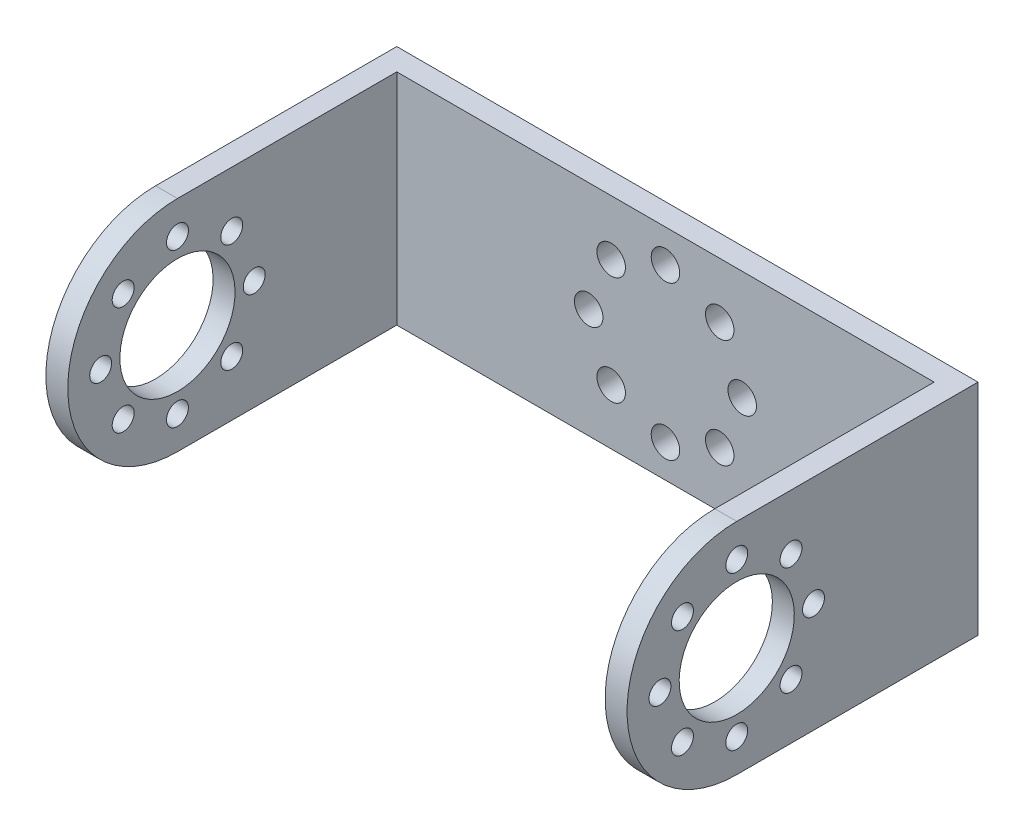
ISO-10303-21;
HEADER;
FILE_DESCRIPTION(('STEP AP214'),'2;1');
FILE_NAME('part.step','',(''),(''),'','','');
FILE_SCHEMA(('AUTOMOTIVE_DESIGN { 1 0 10303 214 1 1 1 1 }'));
ENDSEC;
DATA;
#1=APPLICATION_CONTEXT('core data for automotive mechanical design processes');
#2=APPLICATION_PROTOCOL_DEFINITION('international standard','automotive_design',2000,#1);
#3=PRODUCT_CONTEXT('',#1,'mechanical');
#4=PRODUCT('Part','Part','',(#3));
#5=PRODUCT_RELATED_PRODUCT_CATEGORY('part','',(#4));
#6=PRODUCT_DEFINITION_FORMATION('','',#4);
#7=PRODUCT_DEFINITION_CONTEXT('part definition',#1,'design');
#8=PRODUCT_DEFINITION('design','',#6,#7);
#9=PRODUCT_DEFINITION_SHAPE('','',#8);
#10=(LENGTH_UNIT() NAMED_UNIT(*) SI_UNIT(.MILLI.,.METRE.));
#11=(NAMED_UNIT(*) PLANE_ANGLE_UNIT() SI_UNIT($,.RADIAN.));
#12=(NAMED_UNIT(*) SI_UNIT($,.STERADIAN.) SOLID_ANGLE_UNIT());
#13=UNCERTAINTY_MEASURE_WITH_UNIT(LENGTH_MEASURE(1.E-05),#10,'distance_accuracy_value','');
#14=(GEOMETRIC_REPRESENTATION_CONTEXT(3) GLOBAL_UNCERTAINTY_ASSIGNED_CONTEXT((#13)) GLOBAL_UNIT_ASSIGNED_CONTEXT((#10,
#11,#12)) REPRESENTATION_CONTEXT('',''));
#15=CARTESIAN_POINT('',(0.,0.,0.));
#16=DIRECTION('',(0.,0.,1.));
#17=DIRECTION('',(1.,0.,0.));
#18=AXIS2_PLACEMENT_3D('',#15,#16,#17);
#19=CARTESIAN_POINT('',(26.5,10.,2.));
#20=DIRECTION('',(-1.,0.,0.));
#21=DIRECTION('',(0.,0.,1.));
#22=AXIS2_PLACEMENT_3D('',#19,#20,#21);
#23=PLANE('',#22);
#24=CARTESIAN_POINT('',(26.5,0.,29.));
#25=DIRECTION('',(-1.,0.,0.));
#26=DIRECTION('',(0.,-1.,0.));
#27=AXIS2_PLACEMENT_3D('',#24,#25,#26);
#28=CIRCLE('',#27,0.999999999999998);
#29=CARTESIAN_POINT('',(26.5,-1.,29.));
#30=VERTEX_POINT('',#29);
#31=EDGE_CURVE('E253',#30,#30,#28,.T.);
#32=ORIENTED_EDGE('',*,*,#31,.T.);
#33=EDGE_LOOP('',(#32));
#34=FACE_BOUND('',#33,.T.);
#35=CARTESIAN_POINT('',(26.5,4.94974746830582,17.0502525316942));
#36=DIRECTION('',(-1.,0.,0.));
#37=DIRECTION('',(0.,-1.,0.));
#38=AXIS2_PLACEMENT_3D('',#35,#36,#37);
#39=CIRCLE('',#38,0.999999999999998);
#40=CARTESIAN_POINT('',(26.5,3.94974746830583,17.0502525316942));
#41=VERTEX_POINT('',#40);
#42=EDGE_CURVE('E259',#41,#41,#39,.T.);
#43=ORIENTED_EDGE('',*,*,#42,.T.);
#44=EDGE_LOOP('',(#43));
#45=FACE_BOUND('',#44,.T.);
#46=CARTESIAN_POINT('',(26.5,6.99999999999999,22.));
#47=DIRECTION('',(-1.,0.,0.));
#48=DIRECTION('',(0.,-1.,0.));
#49=AXIS2_PLACEMENT_3D('',#46,#47,#48);
#50=CIRCLE('',#49,0.999999999999998);
#51=CARTESIAN_POINT('',(26.5,6.,22.));
#52=VERTEX_POINT('',#51);
#53=EDGE_CURVE('E260',#52,#52,#50,.T.);
#54=ORIENTED_EDGE('',*,*,#53,.T.);
#55=EDGE_LOOP('',(#54));
#56=FACE_BOUND('',#55,.T.);
#57=CARTESIAN_POINT('',(26.5,0.,22.));
#58=DIRECTION('',(-1.,0.,0.));
#59=DIRECTION('',(0.,-1.,0.));
#60=AXIS2_PLACEMENT_3D('',#57,#58,#59);
#61=CIRCLE('',#60,5.25);
#62=CARTESIAN_POINT('',(26.5,-5.25,22.));
#63=VERTEX_POINT('',#62);
#64=EDGE_CURVE('E276',#63,#63,#61,.T.);
#65=ORIENTED_EDGE('',*,*,#64,.T.);
#66=EDGE_LOOP('',(#65));
#67=FACE_BOUND('',#66,.T.);
#68=CARTESIAN_POINT('',(26.5,4.94974746830583,26.9497474683058));
#69=DIRECTION('',(-1.,0.,0.));
#70=DIRECTION('',(0.,-1.,0.));
#71=AXIS2_PLACEMENT_3D('',#68,#69,#70);
#72=CIRCLE('',#71,0.999999999999998);
#73=CARTESIAN_POINT('',(26.5,3.94974746830583,26.9497474683058));
#74=VERTEX_POINT('',#73);
#75=EDGE_CURVE('E270',#74,#74,#72,.T.);
#76=ORIENTED_EDGE('',*,*,#75,.T.);
#77=EDGE_LOOP('',(#76));
#78=FACE_BOUND('',#77,.T.);
#79=CARTESIAN_POINT('',(26.5,0.,15.));
#80=DIRECTION('',(-1.,0.,0.));
#81=DIRECTION('',(0.,-1.,0.));
#82=AXIS2_PLACEMENT_3D('',#79,#80,#81);
#83=CIRCLE('',#82,1.);
#84=CARTESIAN_POINT('',(26.5,-1.,15.));
#85=VERTEX_POINT('',#84);
#86=EDGE_CURVE('E234',#85,#85,#83,.T.);
#87=ORIENTED_EDGE('',*,*,#86,.T.);
#88=EDGE_LOOP('',(#87));
#89=FACE_BOUND('',#88,.T.);
#90=CARTESIAN_POINT('',(26.5,-4.94974746830584,17.0502525316942));
#91=DIRECTION('',(-1.,0.,0.));
#92=DIRECTION('',(0.,-1.,0.));
#93=AXIS2_PLACEMENT_3D('',#90,#91,#92);
#94=CIRCLE('',#93,0.999999999999998);
#95=CARTESIAN_POINT('',(26.5,-5.94974746830583,17.0502525316942));
#96=VERTEX_POINT('',#95);
#97=EDGE_CURVE('E233',#96,#96,#94,.T.);
#98=ORIENTED_EDGE('',*,*,#97,.T.);
#99=EDGE_LOOP('',(#98));
#100=FACE_BOUND('',#99,.T.);
#101=CARTESIAN_POINT('',(26.5,-7.,22.));
#102=DIRECTION('',(-1.,0.,0.));
#103=DIRECTION('',(0.,-1.,0.));
#104=AXIS2_PLACEMENT_3D('',#101,#102,#103);
#105=CIRCLE('',#104,0.999999999999998);
#106=CARTESIAN_POINT('',(26.5,-8.,22.));
#107=VERTEX_POINT('',#106);
#108=EDGE_CURVE('E241',#107,#107,#105,.T.);
#109=ORIENTED_EDGE('',*,*,#108,.T.);
#110=EDGE_LOOP('',(#109));
#111=FACE_BOUND('',#110,.T.);
#112=CARTESIAN_POINT('',(26.5,-4.94974746830583,26.9497474683058));
#113=DIRECTION('',(-1.,0.,0.));
#114=DIRECTION('',(0.,-1.,0.));
#115=AXIS2_PLACEMENT_3D('',#112,#113,#114);
#116=CIRCLE('',#115,0.999999999999998);
#117=CARTESIAN_POINT('',(26.5,-5.94974746830583,26.9497474683058));
#118=VERTEX_POINT('',#117);
#119=EDGE_CURVE('E247',#118,#118,#116,.T.);
#120=ORIENTED_EDGE('',*,*,#119,.T.);
#121=EDGE_LOOP('',(#120));
#122=FACE_BOUND('',#121,.T.);
#123=CARTESIAN_POINT('',(26.5,0.,22.));
#124=DIRECTION('',(-1.,0.,0.));
#125=DIRECTION('',(0.,0.,1.));
#126=AXIS2_PLACEMENT_3D('',#123,#124,#125);
#127=CIRCLE('',#126,10.);
#128=CARTESIAN_POINT('',(26.5,10.,22.));
#129=VERTEX_POINT('',#128);
#130=CARTESIAN_POINT('',(26.5,-10.,22.));
#131=VERTEX_POINT('',#130);
#132=EDGE_CURVE('E109',#129,#131,#127,.F.);
#133=ORIENTED_EDGE('',*,*,#132,.T.);
#134=DIRECTION('',(0.,0.,-1.));
#135=VECTOR('',#134,1.);
#136=CARTESIAN_POINT('',(26.5,-10.,2.));
#137=LINE('',#136,#135);
#138=CARTESIAN_POINT('',(26.5,-10.,0.));
#139=VERTEX_POINT('',#138);
#140=EDGE_CURVE('E113',#131,#139,#137,.T.);
#141=ORIENTED_EDGE('',*,*,#140,.T.);
#142=DIRECTION('',(0.,1.,0.));
#143=VECTOR('',#142,1.);
#144=CARTESIAN_POINT('',(26.5,10.,0.));
#145=LINE('',#144,#143);
#146=CARTESIAN_POINT('',(26.5,10.,0.));
#147=VERTEX_POINT('',#146);
#148=EDGE_CURVE('E189',#139,#147,#145,.T.);
#149=ORIENTED_EDGE('',*,*,#148,.T.);
#150=DIRECTION('',(0.,0.,-1.));
#151=VECTOR('',#150,1.);
#152=CARTESIAN_POINT('',(26.5,10.,2.));
#153=LINE('',#152,#151);
#154=EDGE_CURVE('E209',#129,#147,#153,.T.);
#155=ORIENTED_EDGE('',*,*,#154,.F.);
#156=EDGE_LOOP('',(#133,#141,#149,#155));
#157=FACE_BOUND('',#156,.T.);
#158=ADVANCED_FACE('F38',(#34,#45,#56,#67,#78,#89,#100,#111,#122,#157),#23,.F.);
#159=CARTESIAN_POINT('',(24.5,10.,32.));
#160=DIRECTION('',(-1.,0.,0.));
#161=DIRECTION('',(0.,-1.,0.));
#162=AXIS2_PLACEMENT_3D('',#159,#160,#161);
#163=PLANE('',#162);
#164=CARTESIAN_POINT('',(24.5,0.,29.));
#165=DIRECTION('',(-1.,0.,0.));
#166=DIRECTION('',(0.,-1.,0.));
#167=AXIS2_PLACEMENT_3D('',#164,#165,#166);
#168=CIRCLE('',#167,0.999999999999998);
#169=CARTESIAN_POINT('',(24.5,-1.,29.));
#170=VERTEX_POINT('',#169);
#171=EDGE_CURVE('E229',#170,#170,#168,.T.);
#172=ORIENTED_EDGE('',*,*,#171,.F.);
#173=EDGE_LOOP('',(#172));
#174=FACE_BOUND('',#173,.T.);
#175=CARTESIAN_POINT('',(24.5,4.94974746830583,17.0502525316942));
#176=DIRECTION('',(-1.,0.,0.));
#177=DIRECTION('',(0.,-1.,0.));
#178=AXIS2_PLACEMENT_3D('',#175,#176,#177);
#179=CIRCLE('',#178,0.999999999999998);
#180=CARTESIAN_POINT('',(24.5,3.94974746830583,17.0502525316942));
#181=VERTEX_POINT('',#180);
#182=EDGE_CURVE('E237',#181,#181,#179,.T.);
#183=ORIENTED_EDGE('',*,*,#182,.F.);
#184=EDGE_LOOP('',(#183));
#185=FACE_BOUND('',#184,.T.);
#186=CARTESIAN_POINT('',(24.5,7.,22.));
#187=DIRECTION('',(-1.,0.,0.));
#188=DIRECTION('',(0.,-1.,0.));
#189=AXIS2_PLACEMENT_3D('',#186,#187,#188);
#190=CIRCLE('',#189,0.999999999999998);
#191=CARTESIAN_POINT('',(24.5,6.,22.));
#192=VERTEX_POINT('',#191);
#193=EDGE_CURVE('E256',#192,#192,#190,.T.);
#194=ORIENTED_EDGE('',*,*,#193,.F.);
#195=EDGE_LOOP('',(#194));
#196=FACE_BOUND('',#195,.T.);
#197=CARTESIAN_POINT('',(24.5,0.,22.));
#198=DIRECTION('',(-1.,0.,0.));
#199=DIRECTION('',(0.,-1.,0.));
#200=AXIS2_PLACEMENT_3D('',#197,#198,#199);
#201=CIRCLE('',#200,5.25);
#202=CARTESIAN_POINT('',(24.5,-5.25,22.));
#203=VERTEX_POINT('',#202);
#204=EDGE_CURVE('E273',#203,#203,#201,.T.);
#205=ORIENTED_EDGE('',*,*,#204,.F.);
#206=EDGE_LOOP('',(#205));
#207=FACE_BOUND('',#206,.T.);
#208=CARTESIAN_POINT('',(24.5,4.94974746830583,26.9497474683058));
#209=DIRECTION('',(-1.,0.,0.));
#210=DIRECTION('',(0.,-1.,0.));
#211=AXIS2_PLACEMENT_3D('',#208,#209,#210);
#212=CIRCLE('',#211,0.999999999999998);
#213=CARTESIAN_POINT('',(24.5,3.94974746830583,26.9497474683058));
#214=VERTEX_POINT('',#213);
#215=EDGE_CURVE('E263',#214,#214,#212,.T.);
#216=ORIENTED_EDGE('',*,*,#215,.F.);
#217=EDGE_LOOP('',(#216));
#218=FACE_BOUND('',#217,.T.);
#219=CARTESIAN_POINT('',(24.5,0.,15.));
#220=DIRECTION('',(-1.,0.,0.));
#221=DIRECTION('',(0.,-1.,0.));
#222=AXIS2_PLACEMENT_3D('',#219,#220,#221);
#223=CIRCLE('',#222,1.);
#224=CARTESIAN_POINT('',(24.5,-1.,15.));
#225=VERTEX_POINT('',#224);
#226=EDGE_CURVE('E230',#225,#225,#223,.T.);
#227=ORIENTED_EDGE('',*,*,#226,.F.);
#228=EDGE_LOOP('',(#227));
#229=FACE_BOUND('',#228,.T.);
#230=CARTESIAN_POINT('',(24.5,-4.94974746830583,17.0502525316942));
#231=DIRECTION('',(-1.,0.,0.));
#232=DIRECTION('',(0.,-1.,0.));
#233=AXIS2_PLACEMENT_3D('',#230,#231,#232);
#234=CIRCLE('',#233,0.999999999999998);
#235=CARTESIAN_POINT('',(24.5,-5.94974746830583,17.0502525316942));
#236=VERTEX_POINT('',#235);
#237=EDGE_CURVE('E238',#236,#236,#234,.T.);
#238=ORIENTED_EDGE('',*,*,#237,.F.);
#239=EDGE_LOOP('',(#238));
#240=FACE_BOUND('',#239,.T.);
#241=CARTESIAN_POINT('',(24.5,-7.,22.));
#242=DIRECTION('',(-1.,0.,0.));
#243=DIRECTION('',(0.,-1.,0.));
#244=AXIS2_PLACEMENT_3D('',#241,#242,#243);
#245=CIRCLE('',#244,0.999999999999998);
#246=CARTESIAN_POINT('',(24.5,-8.,22.));
#247=VERTEX_POINT('',#246);
#248=EDGE_CURVE('E244',#247,#247,#245,.T.);
#249=ORIENTED_EDGE('',*,*,#248,.F.);
#250=EDGE_LOOP('',(#249));
#251=FACE_BOUND('',#250,.T.);
#252=CARTESIAN_POINT('',(24.5,-4.94974746830583,26.9497474683058));
#253=DIRECTION('',(-1.,0.,0.));
#254=DIRECTION('',(0.,-1.,0.));
#255=AXIS2_PLACEMENT_3D('',#252,#253,#254);
#256=CIRCLE('',#255,0.999999999999998);
#257=CARTESIAN_POINT('',(24.5,-5.94974746830583,26.9497474683058));
#258=VERTEX_POINT('',#257);
#259=EDGE_CURVE('E250',#258,#258,#256,.T.);
#260=ORIENTED_EDGE('',*,*,#259,.F.);
#261=EDGE_LOOP('',(#260));
#262=FACE_BOUND('',#261,.T.);
#263=DIRECTION('',(0.,0.,-1.));
#264=VECTOR('',#263,1.);
#265=CARTESIAN_POINT('',(24.5,-10.,32.));
#266=LINE('',#265,#264);
#267=CARTESIAN_POINT('',(24.5,-10.,22.));
#268=VERTEX_POINT('',#267);
#269=CARTESIAN_POINT('',(24.5,-10.,2.));
#270=VERTEX_POINT('',#269);
#271=EDGE_CURVE('E59',#268,#270,#266,.T.);
#272=ORIENTED_EDGE('',*,*,#271,.F.);
#273=CARTESIAN_POINT('',(24.5,0.,22.));
#274=DIRECTION('',(-1.,0.,0.));
#275=DIRECTION('',(0.,-1.,0.));
#276=AXIS2_PLACEMENT_3D('',#273,#274,#275);
#277=CIRCLE('',#276,10.);
#278=CARTESIAN_POINT('',(24.5,10.,22.));
#279=VERTEX_POINT('',#278);
#280=EDGE_CURVE('E104',#279,#268,#277,.F.);
#281=ORIENTED_EDGE('',*,*,#280,.F.);
#282=DIRECTION('',(0.,0.,-1.));
#283=VECTOR('',#282,1.);
#284=CARTESIAN_POINT('',(24.5,10.,32.));
#285=LINE('',#284,#283);
#286=CARTESIAN_POINT('',(24.5,10.,2.));
#287=VERTEX_POINT('',#286);
#288=EDGE_CURVE('E52',#279,#287,#285,.T.);
#289=ORIENTED_EDGE('',*,*,#288,.T.);
#290=DIRECTION('',(0.,1.,0.));
#291=VECTOR('',#290,1.);
#292=CARTESIAN_POINT('',(24.5,10.,2.));
#293=LINE('',#292,#291);
#294=EDGE_CURVE('E115',#270,#287,#293,.T.);
#295=ORIENTED_EDGE('',*,*,#294,.F.);
#296=EDGE_LOOP('',(#272,#281,#289,#295));
#297=FACE_BOUND('',#296,.T.);
#298=ADVANCED_FACE('F114',(#174,#185,#196,#207,#218,#229,#240,#251,#262,#297),#163,.T.);
#299=CARTESIAN_POINT('',(-26.5,10.,2.));
#300=DIRECTION('',(0.,-1.,0.));
#301=DIRECTION('',(0.,0.,-1.));
#302=AXIS2_PLACEMENT_3D('',#299,#300,#301);
#303=PLANE('',#302);
#304=DIRECTION('',(1.,0.,0.));
#305=VECTOR('',#304,1.);
#306=CARTESIAN_POINT('',(-26.5,10.,22.));
#307=LINE('',#306,#305);
#308=EDGE_CURVE('E108',#279,#129,#307,.T.);
#309=ORIENTED_EDGE('',*,*,#308,.T.);
#310=ORIENTED_EDGE('',*,*,#154,.T.);
#311=DIRECTION('',(-1.,0.,0.));
#312=VECTOR('',#311,1.);
#313=CARTESIAN_POINT('',(-26.5,10.,0.));
#314=LINE('',#313,#312);
#315=CARTESIAN_POINT('',(-26.5,10.,0.));
#316=VERTEX_POINT('',#315);
#317=EDGE_CURVE('E197',#147,#316,#314,.T.);
#318=ORIENTED_EDGE('',*,*,#317,.T.);
#319=DIRECTION('',(0.,0.,-1.));
#320=VECTOR('',#319,1.);
#321=CARTESIAN_POINT('',(-26.5,10.,2.));
#322=LINE('',#321,#320);
#323=CARTESIAN_POINT('',(-26.5,10.,22.));
#324=VERTEX_POINT('',#323);
#325=EDGE_CURVE('E207',#324,#316,#322,.T.);
#326=ORIENTED_EDGE('',*,*,#325,.F.);
#327=DIRECTION('',(-1.,0.,0.));
#328=VECTOR('',#327,1.);
#329=CARTESIAN_POINT('',(26.5,10.,22.));
#330=LINE('',#329,#328);
#331=CARTESIAN_POINT('',(-24.5,10.,22.));
#332=VERTEX_POINT('',#331);
#333=EDGE_CURVE('E129',#332,#324,#330,.T.);
#334=ORIENTED_EDGE('',*,*,#333,.F.);
#335=DIRECTION('',(0.,0.,-1.));
#336=VECTOR('',#335,1.);
#337=CARTESIAN_POINT('',(-24.5,10.,32.));
#338=LINE('',#337,#336);
#339=CARTESIAN_POINT('',(-24.5,10.,2.));
#340=VERTEX_POINT('',#339);
#341=EDGE_CURVE('E184',#332,#340,#338,.T.);
#342=ORIENTED_EDGE('',*,*,#341,.T.);
#343=DIRECTION('',(-1.,0.,0.));
#344=VECTOR('',#343,1.);
#345=CARTESIAN_POINT('',(-26.5,10.,2.));
#346=LINE('',#345,#344);
#347=EDGE_CURVE('E190',#287,#340,#346,.T.);
#348=ORIENTED_EDGE('',*,*,#347,.F.);
#349=ORIENTED_EDGE('',*,*,#288,.F.);
#350=EDGE_LOOP('',(#309,#310,#318,#326,#334,#342,#348,#349));
#351=FACE_BOUND('',#350,.T.);
#352=ADVANCED_FACE('F363',(#351),#303,.F.);
#353=CARTESIAN_POINT('',(-26.5,10.,2.));
#354=DIRECTION('',(1.,0.,0.));
#355=DIRECTION('',(0.,1.,0.));
#356=AXIS2_PLACEMENT_3D('',#353,#354,#355);
#357=PLANE('',#356);
#358=CARTESIAN_POINT('',(-26.5,0.,29.));
#359=DIRECTION('',(-1.,0.,0.));
#360=DIRECTION('',(0.,-1.,0.));
#361=AXIS2_PLACEMENT_3D('',#358,#359,#360);
#362=CIRCLE('',#361,0.999999999999998);
#363=CARTESIAN_POINT('',(-26.5,-1.,29.));
#364=VERTEX_POINT('',#363);
#365=EDGE_CURVE('E122',#364,#364,#362,.T.);
#366=ORIENTED_EDGE('',*,*,#365,.F.);
#367=EDGE_LOOP('',(#366));
#368=FACE_BOUND('',#367,.T.);
#369=CARTESIAN_POINT('',(-26.5,4.94974746830582,17.0502525316942));
#370=DIRECTION('',(-1.,0.,0.));
#371=DIRECTION('',(0.,-1.,0.));
#372=AXIS2_PLACEMENT_3D('',#369,#370,#371);
#373=CIRCLE('',#372,0.999999999999998);
#374=CARTESIAN_POINT('',(-26.5,3.94974746830583,17.0502525316942));
#375=VERTEX_POINT('',#374);
#376=EDGE_CURVE('E142',#375,#375,#373,.T.);
#377=ORIENTED_EDGE('',*,*,#376,.F.);
#378=EDGE_LOOP('',(#377));
#379=FACE_BOUND('',#378,.T.);
#380=CARTESIAN_POINT('',(-26.5,6.99999999999999,22.));
#381=DIRECTION('',(-1.,0.,0.));
#382=DIRECTION('',(0.,-1.,0.));
#383=AXIS2_PLACEMENT_3D('',#380,#381,#382);
#384=CIRCLE('',#383,0.999999999999998);
#385=CARTESIAN_POINT('',(-26.5,6.,22.));
#386=VERTEX_POINT('',#385);
#387=EDGE_CURVE('E141',#386,#386,#384,.T.);
#388=ORIENTED_EDGE('',*,*,#387,.F.);
#389=EDGE_LOOP('',(#388));
#390=FACE_BOUND('',#389,.T.);
#391=CARTESIAN_POINT('',(-26.5,0.,22.));
#392=DIRECTION('',(-1.,0.,0.));
#393=DIRECTION('',(0.,-1.,0.));
#394=AXIS2_PLACEMENT_3D('',#391,#392,#393);
#395=CIRCLE('',#394,5.25);
#396=CARTESIAN_POINT('',(-26.5,-5.25,22.));
#397=VERTEX_POINT('',#396);
#398=EDGE_CURVE('E117',#397,#397,#395,.T.);
#399=ORIENTED_EDGE('',*,*,#398,.F.);
#400=EDGE_LOOP('',(#399));
#401=FACE_BOUND('',#400,.T.);
#402=CARTESIAN_POINT('',(-26.5,4.94974746830583,26.9497474683058));
#403=DIRECTION('',(-1.,0.,0.));
#404=DIRECTION('',(0.,-1.,0.));
#405=AXIS2_PLACEMENT_3D('',#402,#403,#404);
#406=CIRCLE('',#405,0.999999999999998);
#407=CARTESIAN_POINT('',(-26.5,3.94974746830583,26.9497474683058));
#408=VERTEX_POINT('',#407);
#409=EDGE_CURVE('E135',#408,#408,#406,.T.);
#410=ORIENTED_EDGE('',*,*,#409,.F.);
#411=EDGE_LOOP('',(#410));
#412=FACE_BOUND('',#411,.T.);
#413=CARTESIAN_POINT('',(-26.5,0.,15.));
#414=DIRECTION('',(-1.,0.,0.));
#415=DIRECTION('',(0.,-1.,0.));
#416=AXIS2_PLACEMENT_3D('',#413,#414,#415);
#417=CIRCLE('',#416,1.);
#418=CARTESIAN_POINT('',(-26.5,-1.,15.));
#419=VERTEX_POINT('',#418);
#420=EDGE_CURVE('E149',#419,#419,#417,.T.);
#421=ORIENTED_EDGE('',*,*,#420,.F.);
#422=EDGE_LOOP('',(#421));
#423=FACE_BOUND('',#422,.T.);
#424=CARTESIAN_POINT('',(-26.5,-4.94974746830584,17.0502525316942));
#425=DIRECTION('',(-1.,0.,0.));
#426=DIRECTION('',(0.,-1.,0.));
#427=AXIS2_PLACEMENT_3D('',#424,#425,#426);
#428=CIRCLE('',#427,0.999999999999998);
#429=CARTESIAN_POINT('',(-26.5,-5.94974746830583,17.0502525316942));
#430=VERTEX_POINT('',#429);
#431=EDGE_CURVE('E166',#430,#430,#428,.T.);
#432=ORIENTED_EDGE('',*,*,#431,.F.);
#433=EDGE_LOOP('',(#432));
#434=FACE_BOUND('',#433,.T.);
#435=CARTESIAN_POINT('',(-26.5,-7.,22.));
#436=DIRECTION('',(-1.,0.,0.));
#437=DIRECTION('',(0.,-1.,0.));
#438=AXIS2_PLACEMENT_3D('',#435,#436,#437);
#439=CIRCLE('',#438,0.999999999999998);
#440=CARTESIAN_POINT('',(-26.5,-8.,22.));
#441=VERTEX_POINT('',#440);
#442=EDGE_CURVE('E160',#441,#441,#439,.T.);
#443=ORIENTED_EDGE('',*,*,#442,.F.);
#444=EDGE_LOOP('',(#443));
#445=FACE_BOUND('',#444,.T.);
#446=CARTESIAN_POINT('',(-26.5,-4.94974746830583,26.9497474683058));
#447=DIRECTION('',(-1.,0.,0.));
#448=DIRECTION('',(0.,-1.,0.));
#449=AXIS2_PLACEMENT_3D('',#446,#447,#448);
#450=CIRCLE('',#449,0.999999999999998);
#451=CARTESIAN_POINT('',(-26.5,-5.94974746830583,26.9497474683058));
#452=VERTEX_POINT('',#451);
#453=EDGE_CURVE('E154',#452,#452,#450,.T.);
#454=ORIENTED_EDGE('',*,*,#453,.F.);
#455=EDGE_LOOP('',(#454));
#456=FACE_BOUND('',#455,.T.);
#457=DIRECTION('',(0.,0.,-1.));
#458=VECTOR('',#457,1.);
#459=CARTESIAN_POINT('',(-26.5,-10.,2.));
#460=LINE('',#459,#458);
#461=CARTESIAN_POINT('',(-26.5,-10.,22.));
#462=VERTEX_POINT('',#461);
#463=CARTESIAN_POINT('',(-26.5,-10.,0.));
#464=VERTEX_POINT('',#463);
#465=EDGE_CURVE('E205',#462,#464,#460,.T.);
#466=ORIENTED_EDGE('',*,*,#465,.F.);
#467=CARTESIAN_POINT('',(-26.5,0.,22.));
#468=DIRECTION('',(1.,0.,0.));
#469=DIRECTION('',(0.,1.,0.));
#470=AXIS2_PLACEMENT_3D('',#467,#468,#469);
#471=CIRCLE('',#470,10.);
#472=EDGE_CURVE('E179',#324,#462,#471,.T.);
#473=ORIENTED_EDGE('',*,*,#472,.F.);
#474=ORIENTED_EDGE('',*,*,#325,.T.);
#475=DIRECTION('',(0.,-1.,0.));
#476=VECTOR('',#475,1.);
#477=CARTESIAN_POINT('',(-26.5,10.,0.));
#478=LINE('',#477,#476);
#479=EDGE_CURVE('E200',#316,#464,#478,.T.);
#480=ORIENTED_EDGE('',*,*,#479,.T.);
#481=EDGE_LOOP('',(#466,#473,#474,#480));
#482=FACE_BOUND('',#481,.T.);
#483=ADVANCED_FACE('F217',(#368,#379,#390,#401,#412,#423,#434,#445,#456,#482),#357,.F.);
#484=CARTESIAN_POINT('',(-24.5,10.,32.));
#485=DIRECTION('',(-1.,0.,0.));
#486=DIRECTION('',(0.,-1.,0.));
#487=AXIS2_PLACEMENT_3D('',#484,#485,#486);
#488=PLANE('',#487);
#489=CARTESIAN_POINT('',(-24.5,0.,29.));
#490=DIRECTION('',(-1.,0.,0.));
#491=DIRECTION('',(0.,-1.,0.));
#492=AXIS2_PLACEMENT_3D('',#489,#490,#491);
#493=CIRCLE('',#492,0.999999999999998);
#494=CARTESIAN_POINT('',(-24.5,-1.,29.));
#495=VERTEX_POINT('',#494);
#496=EDGE_CURVE('E125',#495,#495,#493,.F.);
#497=ORIENTED_EDGE('',*,*,#496,.F.);
#498=EDGE_LOOP('',(#497));
#499=FACE_BOUND('',#498,.T.);
#500=CARTESIAN_POINT('',(-24.5,4.94974746830583,17.0502525316942));
#501=DIRECTION('',(-1.,0.,0.));
#502=DIRECTION('',(0.,-1.,0.));
#503=AXIS2_PLACEMENT_3D('',#500,#501,#502);
#504=CIRCLE('',#503,0.999999999999998);
#505=CARTESIAN_POINT('',(-24.5,3.94974746830583,17.0502525316942));
#506=VERTEX_POINT('',#505);
#507=EDGE_CURVE('E145',#506,#506,#504,.F.);
#508=ORIENTED_EDGE('',*,*,#507,.F.);
#509=EDGE_LOOP('',(#508));
#510=FACE_BOUND('',#509,.T.);
#511=CARTESIAN_POINT('',(-24.5,7.,22.));
#512=DIRECTION('',(-1.,0.,0.));
#513=DIRECTION('',(0.,-1.,0.));
#514=AXIS2_PLACEMENT_3D('',#511,#512,#513);
#515=CIRCLE('',#514,0.999999999999998);
#516=CARTESIAN_POINT('',(-24.5,6.,22.));
#517=VERTEX_POINT('',#516);
#518=EDGE_CURVE('E146',#517,#517,#515,.F.);
#519=ORIENTED_EDGE('',*,*,#518,.F.);
#520=EDGE_LOOP('',(#519));
#521=FACE_BOUND('',#520,.T.);
#522=CARTESIAN_POINT('',(-24.5,0.,22.));
#523=DIRECTION('',(-1.,0.,0.));
#524=DIRECTION('',(0.,-1.,0.));
#525=AXIS2_PLACEMENT_3D('',#522,#523,#524);
#526=CIRCLE('',#525,5.25);
#527=CARTESIAN_POINT('',(-24.5,-5.25,22.));
#528=VERTEX_POINT('',#527);
#529=EDGE_CURVE('E132',#528,#528,#526,.F.);
#530=ORIENTED_EDGE('',*,*,#529,.F.);
#531=EDGE_LOOP('',(#530));
#532=FACE_BOUND('',#531,.T.);
#533=CARTESIAN_POINT('',(-24.5,4.94974746830583,26.9497474683058));
#534=DIRECTION('',(-1.,0.,0.));
#535=DIRECTION('',(0.,-1.,0.));
#536=AXIS2_PLACEMENT_3D('',#533,#534,#535);
#537=CIRCLE('',#536,0.999999999999998);
#538=CARTESIAN_POINT('',(-24.5,3.94974746830583,26.9497474683058));
#539=VERTEX_POINT('',#538);
#540=EDGE_CURVE('E138',#539,#539,#537,.F.);
#541=ORIENTED_EDGE('',*,*,#540,.F.);
#542=EDGE_LOOP('',(#541));
#543=FACE_BOUND('',#542,.T.);
#544=CARTESIAN_POINT('',(-24.5,0.,15.));
#545=DIRECTION('',(-1.,0.,0.));
#546=DIRECTION('',(0.,-1.,0.));
#547=AXIS2_PLACEMENT_3D('',#544,#545,#546);
#548=CIRCLE('',#547,1.);
#549=CARTESIAN_POINT('',(-24.5,-1.,15.));
#550=VERTEX_POINT('',#549);
#551=EDGE_CURVE('E169',#550,#550,#548,.F.);
#552=ORIENTED_EDGE('',*,*,#551,.F.);
#553=EDGE_LOOP('',(#552));
#554=FACE_BOUND('',#553,.T.);
#555=CARTESIAN_POINT('',(-24.5,-4.94974746830583,17.0502525316942));
#556=DIRECTION('',(-1.,0.,0.));
#557=DIRECTION('',(0.,-1.,0.));
#558=AXIS2_PLACEMENT_3D('',#555,#556,#557);
#559=CIRCLE('',#558,0.999999999999998);
#560=CARTESIAN_POINT('',(-24.5,-5.94974746830583,17.0502525316942));
#561=VERTEX_POINT('',#560);
#562=EDGE_CURVE('E163',#561,#561,#559,.F.);
#563=ORIENTED_EDGE('',*,*,#562,.F.);
#564=EDGE_LOOP('',(#563));
#565=FACE_BOUND('',#564,.T.);
#566=CARTESIAN_POINT('',(-24.5,-7.,22.));
#567=DIRECTION('',(-1.,0.,0.));
#568=DIRECTION('',(0.,-1.,0.));
#569=AXIS2_PLACEMENT_3D('',#566,#567,#568);
#570=CIRCLE('',#569,0.999999999999998);
#571=CARTESIAN_POINT('',(-24.5,-8.,22.));
#572=VERTEX_POINT('',#571);
#573=EDGE_CURVE('E157',#572,#572,#570,.F.);
#574=ORIENTED_EDGE('',*,*,#573,.F.);
#575=EDGE_LOOP('',(#574));
#576=FACE_BOUND('',#575,.T.);
#577=CARTESIAN_POINT('',(-24.5,-4.94974746830583,26.9497474683058));
#578=DIRECTION('',(-1.,0.,0.));
#579=DIRECTION('',(0.,-1.,0.));
#580=AXIS2_PLACEMENT_3D('',#577,#578,#579);
#581=CIRCLE('',#580,0.999999999999998);
#582=CARTESIAN_POINT('',(-24.5,-5.94974746830583,26.9497474683058));
#583=VERTEX_POINT('',#582);
#584=EDGE_CURVE('E126',#583,#583,#581,.F.);
#585=ORIENTED_EDGE('',*,*,#584,.F.);
#586=EDGE_LOOP('',(#585));
#587=FACE_BOUND('',#586,.T.);
#588=CARTESIAN_POINT('',(-24.5,0.,22.));
#589=DIRECTION('',(-1.,0.,0.));
#590=DIRECTION('',(0.,-1.,0.));
#591=AXIS2_PLACEMENT_3D('',#588,#589,#590);
#592=CIRCLE('',#591,10.);
#593=CARTESIAN_POINT('',(-24.5,-10.,22.));
#594=VERTEX_POINT('',#593);
#595=EDGE_CURVE('E177',#594,#332,#592,.T.);
#596=ORIENTED_EDGE('',*,*,#595,.F.);
#597=DIRECTION('',(0.,0.,-1.));
#598=VECTOR('',#597,1.);
#599=CARTESIAN_POINT('',(-24.5,-10.,32.));
#600=LINE('',#599,#598);
#601=CARTESIAN_POINT('',(-24.5,-10.,2.));
#602=VERTEX_POINT('',#601);
#603=EDGE_CURVE('E187',#594,#602,#600,.T.);
#604=ORIENTED_EDGE('',*,*,#603,.T.);
#605=DIRECTION('',(0.,1.,0.));
#606=VECTOR('',#605,1.);
#607=CARTESIAN_POINT('',(-24.5,10.,2.));
#608=LINE('',#607,#606);
#609=EDGE_CURVE('E181',#602,#340,#608,.T.);
#610=ORIENTED_EDGE('',*,*,#609,.T.);
#611=ORIENTED_EDGE('',*,*,#341,.F.);
#612=EDGE_LOOP('',(#596,#604,#610,#611));
#613=FACE_BOUND('',#612,.T.);
#614=ADVANCED_FACE('F447',(#499,#510,#521,#532,#543,#554,#565,#576,#587,#613),#488,.F.);
#615=CARTESIAN_POINT('',(-26.5,-10.,2.));
#616=DIRECTION('',(0.,1.,0.));
#617=DIRECTION('',(0.,0.,1.));
#618=AXIS2_PLACEMENT_3D('',#615,#616,#617);
#619=PLANE('',#618);
#620=ORIENTED_EDGE('',*,*,#140,.F.);
#621=DIRECTION('',(-1.,0.,0.));
#622=VECTOR('',#621,1.);
#623=CARTESIAN_POINT('',(54.5,-10.,22.));
#624=LINE('',#623,#622);
#625=EDGE_CURVE('E11',#131,#268,#624,.T.);
#626=ORIENTED_EDGE('',*,*,#625,.T.);
#627=ORIENTED_EDGE('',*,*,#271,.T.);
#628=DIRECTION('',(1.,0.,0.));
#629=VECTOR('',#628,1.);
#630=CARTESIAN_POINT('',(-26.5,-10.,2.));
#631=LINE('',#630,#629);
#632=EDGE_CURVE('E192',#602,#270,#631,.T.);
#633=ORIENTED_EDGE('',*,*,#632,.F.);
#634=ORIENTED_EDGE('',*,*,#603,.F.);
#635=DIRECTION('',(1.,0.,0.));
#636=VECTOR('',#635,1.);
#637=CARTESIAN_POINT('',(-54.5,-10.,22.));
#638=LINE('',#637,#636);
#639=EDGE_CURVE('E45',#594,#462,#638,.F.);
#640=ORIENTED_EDGE('',*,*,#639,.T.);
#641=ORIENTED_EDGE('',*,*,#465,.T.);
#642=DIRECTION('',(1.,0.,0.));
#643=VECTOR('',#642,1.);
#644=CARTESIAN_POINT('',(-26.5,-10.,0.));
#645=LINE('',#644,#643);
#646=EDGE_CURVE('E193',#464,#139,#645,.T.);
#647=ORIENTED_EDGE('',*,*,#646,.T.);
#648=EDGE_LOOP('',(#620,#626,#627,#633,#634,#640,#641,#647));
#649=FACE_BOUND('',#648,.T.);
#650=ADVANCED_FACE('F111',(#649),#619,.F.);
#651=CARTESIAN_POINT('',(0.,0.,2.));
#652=DIRECTION('',(0.,0.,1.));
#653=DIRECTION('',(1.,0.,0.));
#654=AXIS2_PLACEMENT_3D('',#651,#652,#653);
#655=PLANE('',#654);
#656=CARTESIAN_POINT('',(4.94974746830589,-4.94974746830577,2.));
#657=DIRECTION('',(0.,0.,1.));
#658=DIRECTION('',(1.,0.,0.));
#659=AXIS2_PLACEMENT_3D('',#656,#657,#658);
#660=CIRCLE('',#659,1.3);
#661=CARTESIAN_POINT('',(6.24974746830589,-4.94974746830577,2.));
#662=VERTEX_POINT('',#661);
#663=EDGE_CURVE('E279',#662,#662,#660,.T.);
#664=ORIENTED_EDGE('',*,*,#663,.F.);
#665=EDGE_LOOP('',(#664));
#666=FACE_BOUND('',#665,.T.);
#667=CARTESIAN_POINT('',(0.,-7.,2.));
#668=DIRECTION('',(0.,0.,1.));
#669=DIRECTION('',(1.,0.,0.));
#670=AXIS2_PLACEMENT_3D('',#667,#668,#669);
#671=CIRCLE('',#670,1.3);
#672=CARTESIAN_POINT('',(1.30000000000007,-7.,2.));
#673=VERTEX_POINT('',#672);
#674=EDGE_CURVE('E286',#673,#673,#671,.T.);
#675=ORIENTED_EDGE('',*,*,#674,.F.);
#676=EDGE_LOOP('',(#675));
#677=FACE_BOUND('',#676,.T.);
#678=CARTESIAN_POINT('',(-4.94974746830579,-4.94974746830588,2.));
#679=DIRECTION('',(0.,0.,1.));
#680=DIRECTION('',(1.,0.,0.));
#681=AXIS2_PLACEMENT_3D('',#678,#679,#680);
#682=CIRCLE('',#681,1.3);
#683=CARTESIAN_POINT('',(-3.64974746830579,-4.94974746830588,2.));
#684=VERTEX_POINT('',#683);
#685=EDGE_CURVE('E289',#684,#684,#682,.T.);
#686=ORIENTED_EDGE('',*,*,#685,.F.);
#687=EDGE_LOOP('',(#686));
#688=FACE_BOUND('',#687,.T.);
#689=CARTESIAN_POINT('',(-7.,0.,2.));
#690=DIRECTION('',(0.,0.,1.));
#691=DIRECTION('',(1.,0.,0.));
#692=AXIS2_PLACEMENT_3D('',#689,#690,#691);
#693=CIRCLE('',#692,1.3);
#694=CARTESIAN_POINT('',(-5.7,0.,2.));
#695=VERTEX_POINT('',#694);
#696=EDGE_CURVE('E292',#695,#695,#693,.T.);
#697=ORIENTED_EDGE('',*,*,#696,.F.);
#698=EDGE_LOOP('',(#697));
#699=FACE_BOUND('',#698,.T.);
#700=CARTESIAN_POINT('',(-4.94974746830586,4.94974746830581,2.));
#701=DIRECTION('',(0.,0.,1.));
#702=DIRECTION('',(1.,0.,0.));
#703=AXIS2_PLACEMENT_3D('',#700,#701,#702);
#704=CIRCLE('',#703,1.3);
#705=CARTESIAN_POINT('',(-3.64974746830586,4.94974746830581,2.));
#706=VERTEX_POINT('',#705);
#707=EDGE_CURVE('E295',#706,#706,#704,.T.);
#708=ORIENTED_EDGE('',*,*,#707,.F.);
#709=EDGE_LOOP('',(#708));
#710=FACE_BOUND('',#709,.T.);
#711=CARTESIAN_POINT('',(0.,7.,2.));
#712=DIRECTION('',(0.,0.,1.));
#713=DIRECTION('',(1.,0.,0.));
#714=AXIS2_PLACEMENT_3D('',#711,#712,#713);
#715=CIRCLE('',#714,1.3);
#716=CARTESIAN_POINT('',(1.29999999999998,7.,2.));
#717=VERTEX_POINT('',#716);
#718=EDGE_CURVE('E298',#717,#717,#715,.T.);
#719=ORIENTED_EDGE('',*,*,#718,.F.);
#720=EDGE_LOOP('',(#719));
#721=FACE_BOUND('',#720,.T.);
#722=CARTESIAN_POINT('',(4.94974746830583,4.94974746830584,2.));
#723=DIRECTION('',(0.,0.,1.));
#724=DIRECTION('',(1.,0.,0.));
#725=AXIS2_PLACEMENT_3D('',#722,#723,#724);
#726=CIRCLE('',#725,1.3);
#727=CARTESIAN_POINT('',(6.24974746830583,4.94974746830584,2.));
#728=VERTEX_POINT('',#727);
#729=EDGE_CURVE('E301',#728,#728,#726,.T.);
#730=ORIENTED_EDGE('',*,*,#729,.F.);
#731=EDGE_LOOP('',(#730));
#732=FACE_BOUND('',#731,.T.);
#733=CARTESIAN_POINT('',(7.,0.,2.));
#734=DIRECTION('',(0.,0.,1.));
#735=DIRECTION('',(1.,0.,0.));
#736=AXIS2_PLACEMENT_3D('',#733,#734,#735);
#737=CIRCLE('',#736,1.3);
#738=CARTESIAN_POINT('',(8.3,0.,2.));
#739=VERTEX_POINT('',#738);
#740=EDGE_CURVE('E304',#739,#739,#737,.T.);
#741=ORIENTED_EDGE('',*,*,#740,.F.);
#742=EDGE_LOOP('',(#741));
#743=FACE_BOUND('',#742,.T.);
#744=ORIENTED_EDGE('',*,*,#294,.T.);
#745=ORIENTED_EDGE('',*,*,#347,.T.);
#746=ORIENTED_EDGE('',*,*,#609,.F.);
#747=ORIENTED_EDGE('',*,*,#632,.T.);
#748=EDGE_LOOP('',(#744,#745,#746,#747));
#749=FACE_BOUND('',#748,.T.);
#750=ADVANCED_FACE('F337',(#666,#677,#688,#699,#710,#721,#732,#743,#749),#655,.T.);
#751=CARTESIAN_POINT('',(0.,0.,0.));
#752=DIRECTION('',(0.,0.,1.));
#753=DIRECTION('',(1.,0.,0.));
#754=AXIS2_PLACEMENT_3D('',#751,#752,#753);
#755=PLANE('',#754);
#756=CARTESIAN_POINT('',(4.94974746830589,-4.94974746830577,0.));
#757=DIRECTION('',(0.,0.,-1.));
#758=DIRECTION('',(-1.,0.,0.));
#759=AXIS2_PLACEMENT_3D('',#756,#757,#758);
#760=CIRCLE('',#759,1.3);
#761=CARTESIAN_POINT('',(3.64974746830589,-4.94974746830577,0.));
#762=VERTEX_POINT('',#761);
#763=EDGE_CURVE('E311',#762,#762,#760,.T.);
#764=ORIENTED_EDGE('',*,*,#763,.F.);
#765=EDGE_LOOP('',(#764));
#766=FACE_BOUND('',#765,.T.);
#767=CARTESIAN_POINT('',(0.,-7.,0.));
#768=DIRECTION('',(0.,0.,-1.));
#769=DIRECTION('',(-1.,0.,0.));
#770=AXIS2_PLACEMENT_3D('',#767,#768,#769);
#771=CIRCLE('',#770,1.3);
#772=CARTESIAN_POINT('',(-1.29999999999993,-7.,0.));
#773=VERTEX_POINT('',#772);
#774=EDGE_CURVE('E314',#773,#773,#771,.T.);
#775=ORIENTED_EDGE('',*,*,#774,.F.);
#776=EDGE_LOOP('',(#775));
#777=FACE_BOUND('',#776,.T.);
#778=CARTESIAN_POINT('',(-4.94974746830579,-4.94974746830588,0.));
#779=DIRECTION('',(0.,0.,-1.));
#780=DIRECTION('',(-1.,0.,0.));
#781=AXIS2_PLACEMENT_3D('',#778,#779,#780);
#782=CIRCLE('',#781,1.3);
#783=CARTESIAN_POINT('',(-6.24974746830579,-4.94974746830588,0.));
#784=VERTEX_POINT('',#783);
#785=EDGE_CURVE('E317',#784,#784,#782,.T.);
#786=ORIENTED_EDGE('',*,*,#785,.F.);
#787=EDGE_LOOP('',(#786));
#788=FACE_BOUND('',#787,.T.);
#789=CARTESIAN_POINT('',(-7.,0.,0.));
#790=DIRECTION('',(0.,0.,-1.));
#791=DIRECTION('',(-1.,0.,0.));
#792=AXIS2_PLACEMENT_3D('',#789,#790,#791);
#793=CIRCLE('',#792,1.3);
#794=CARTESIAN_POINT('',(-8.3,0.,0.));
#795=VERTEX_POINT('',#794);
#796=EDGE_CURVE('E320',#795,#795,#793,.T.);
#797=ORIENTED_EDGE('',*,*,#796,.F.);
#798=EDGE_LOOP('',(#797));
#799=FACE_BOUND('',#798,.T.);
#800=CARTESIAN_POINT('',(-4.94974746830586,4.94974746830581,0.));
#801=DIRECTION('',(0.,0.,-1.));
#802=DIRECTION('',(-1.,0.,0.));
#803=AXIS2_PLACEMENT_3D('',#800,#801,#802);
#804=CIRCLE('',#803,1.3);
#805=CARTESIAN_POINT('',(-6.24974746830586,4.94974746830581,0.));
#806=VERTEX_POINT('',#805);
#807=EDGE_CURVE('E323',#806,#806,#804,.T.);
#808=ORIENTED_EDGE('',*,*,#807,.F.);
#809=EDGE_LOOP('',(#808));
#810=FACE_BOUND('',#809,.T.);
#811=CARTESIAN_POINT('',(0.,7.,0.));
#812=DIRECTION('',(0.,0.,-1.));
#813=DIRECTION('',(-1.,0.,0.));
#814=AXIS2_PLACEMENT_3D('',#811,#812,#813);
#815=CIRCLE('',#814,1.3);
#816=CARTESIAN_POINT('',(-1.30000000000002,7.,0.));
#817=VERTEX_POINT('',#816);
#818=EDGE_CURVE('E326',#817,#817,#815,.T.);
#819=ORIENTED_EDGE('',*,*,#818,.F.);
#820=EDGE_LOOP('',(#819));
#821=FACE_BOUND('',#820,.T.);
#822=CARTESIAN_POINT('',(4.94974746830583,4.94974746830584,0.));
#823=DIRECTION('',(0.,0.,-1.));
#824=DIRECTION('',(-1.,0.,0.));
#825=AXIS2_PLACEMENT_3D('',#822,#823,#824);
#826=CIRCLE('',#825,1.3);
#827=CARTESIAN_POINT('',(3.64974746830583,4.94974746830584,0.));
#828=VERTEX_POINT('',#827);
#829=EDGE_CURVE('E310',#828,#828,#826,.T.);
#830=ORIENTED_EDGE('',*,*,#829,.F.);
#831=EDGE_LOOP('',(#830));
#832=FACE_BOUND('',#831,.T.);
#833=CARTESIAN_POINT('',(7.,0.,0.));
#834=DIRECTION('',(0.,0.,-1.));
#835=DIRECTION('',(-1.,0.,0.));
#836=AXIS2_PLACEMENT_3D('',#833,#834,#835);
#837=CIRCLE('',#836,1.3);
#838=CARTESIAN_POINT('',(5.7,0.,0.));
#839=VERTEX_POINT('',#838);
#840=EDGE_CURVE('E307',#839,#839,#837,.T.);
#841=ORIENTED_EDGE('',*,*,#840,.F.);
#842=EDGE_LOOP('',(#841));
#843=FACE_BOUND('',#842,.T.);
#844=ORIENTED_EDGE('',*,*,#148,.F.);
#845=ORIENTED_EDGE('',*,*,#646,.F.);
#846=ORIENTED_EDGE('',*,*,#479,.F.);
#847=ORIENTED_EDGE('',*,*,#317,.F.);
#848=EDGE_LOOP('',(#844,#845,#846,#847));
#849=FACE_BOUND('',#848,.T.);
#850=ADVANCED_FACE('F224',(#766,#777,#788,#799,#810,#821,#832,#843,#849),#755,.F.);
#851=CARTESIAN_POINT('',(26.5,0.,22.));
#852=DIRECTION('',(-1.,0.,0.));
#853=DIRECTION('',(0.,-1.,0.));
#854=AXIS2_PLACEMENT_3D('',#851,#852,#853);
#855=CYLINDRICAL_SURFACE('',#854,10.);
#856=ORIENTED_EDGE('',*,*,#595,.T.);
#857=ORIENTED_EDGE('',*,*,#333,.T.);
#858=ORIENTED_EDGE('',*,*,#472,.T.);
#859=ORIENTED_EDGE('',*,*,#639,.F.);
#860=EDGE_LOOP('',(#856,#857,#858,#859));
#861=FACE_BOUND('',#860,.T.);
#862=ADVANCED_FACE('F336',(#861),#855,.T.);
#863=CARTESIAN_POINT('',(26.501,-4.94974746830582,26.9497474683058));
#864=DIRECTION('',(-1.,0.,0.));
#865=DIRECTION('',(0.,-1.,0.));
#866=AXIS2_PLACEMENT_3D('',#863,#864,#865);
#867=CYLINDRICAL_SURFACE('',#866,0.999999999999998);
#868=ORIENTED_EDGE('',*,*,#453,.T.);
#869=EDGE_LOOP('',(#868));
#870=FACE_BOUND('',#869,.T.);
#871=ORIENTED_EDGE('',*,*,#584,.T.);
#872=EDGE_LOOP('',(#871));
#873=FACE_BOUND('',#872,.T.);
#874=ADVANCED_FACE('F430',(#870,#873),#867,.F.);
#875=CARTESIAN_POINT('',(26.501,-6.99999999999999,22.));
#876=DIRECTION('',(-1.,0.,0.));
#877=DIRECTION('',(0.,-1.,0.));
#878=AXIS2_PLACEMENT_3D('',#875,#876,#877);
#879=CYLINDRICAL_SURFACE('',#878,0.999999999999998);
#880=ORIENTED_EDGE('',*,*,#442,.T.);
#881=EDGE_LOOP('',(#880));
#882=FACE_BOUND('',#881,.T.);
#883=ORIENTED_EDGE('',*,*,#573,.T.);
#884=EDGE_LOOP('',(#883));
#885=FACE_BOUND('',#884,.T.);
#886=ADVANCED_FACE('F433',(#882,#885),#879,.F.);
#887=CARTESIAN_POINT('',(26.501,-4.94974746830583,17.0502525316942));
#888=DIRECTION('',(-1.,0.,0.));
#889=DIRECTION('',(0.,-1.,0.));
#890=AXIS2_PLACEMENT_3D('',#887,#888,#889);
#891=CYLINDRICAL_SURFACE('',#890,0.999999999999998);
#892=ORIENTED_EDGE('',*,*,#431,.T.);
#893=EDGE_LOOP('',(#892));
#894=FACE_BOUND('',#893,.T.);
#895=ORIENTED_EDGE('',*,*,#562,.T.);
#896=EDGE_LOOP('',(#895));
#897=FACE_BOUND('',#896,.T.);
#898=ADVANCED_FACE('F437',(#894,#897),#891,.F.);
#899=CARTESIAN_POINT('',(26.501,0.,15.));
#900=DIRECTION('',(-1.,0.,0.));
#901=DIRECTION('',(0.,-1.,0.));
#902=AXIS2_PLACEMENT_3D('',#899,#900,#901);
#903=CYLINDRICAL_SURFACE('',#902,1.);
#904=ORIENTED_EDGE('',*,*,#420,.T.);
#905=EDGE_LOOP('',(#904));
#906=FACE_BOUND('',#905,.T.);
#907=ORIENTED_EDGE('',*,*,#551,.T.);
#908=EDGE_LOOP('',(#907));
#909=FACE_BOUND('',#908,.T.);
#910=ADVANCED_FACE('F422',(#906,#909),#903,.F.);
#911=CARTESIAN_POINT('',(26.501,4.94974746830584,26.9497474683058));
#912=DIRECTION('',(-1.,0.,0.));
#913=DIRECTION('',(0.,-1.,0.));
#914=AXIS2_PLACEMENT_3D('',#911,#912,#913);
#915=CYLINDRICAL_SURFACE('',#914,0.999999999999998);
#916=ORIENTED_EDGE('',*,*,#409,.T.);
#917=EDGE_LOOP('',(#916));
#918=FACE_BOUND('',#917,.T.);
#919=ORIENTED_EDGE('',*,*,#540,.T.);
#920=EDGE_LOOP('',(#919));
#921=FACE_BOUND('',#920,.T.);
#922=ADVANCED_FACE('F418',(#918,#921),#915,.F.);
#923=CARTESIAN_POINT('',(26.501,0.,22.));
#924=DIRECTION('',(-1.,0.,0.));
#925=DIRECTION('',(0.,-1.,0.));
#926=AXIS2_PLACEMENT_3D('',#923,#924,#925);
#927=CYLINDRICAL_SURFACE('',#926,5.25);
#928=ORIENTED_EDGE('',*,*,#398,.T.);
#929=EDGE_LOOP('',(#928));
#930=FACE_BOUND('',#929,.T.);
#931=ORIENTED_EDGE('',*,*,#529,.T.);
#932=EDGE_LOOP('',(#931));
#933=FACE_BOUND('',#932,.T.);
#934=ADVANCED_FACE('F414',(#930,#933),#927,.F.);
#935=CARTESIAN_POINT('',(26.501,7.,22.));
#936=DIRECTION('',(-1.,0.,0.));
#937=DIRECTION('',(0.,-1.,0.));
#938=AXIS2_PLACEMENT_3D('',#935,#936,#937);
#939=CYLINDRICAL_SURFACE('',#938,0.999999999999998);
#940=ORIENTED_EDGE('',*,*,#387,.T.);
#941=EDGE_LOOP('',(#940));
#942=FACE_BOUND('',#941,.T.);
#943=ORIENTED_EDGE('',*,*,#518,.T.);
#944=EDGE_LOOP('',(#943));
#945=FACE_BOUND('',#944,.T.);
#946=ADVANCED_FACE('F417',(#942,#945),#939,.F.);
#947=CARTESIAN_POINT('',(26.501,4.94974746830583,17.0502525316942));
#948=DIRECTION('',(-1.,0.,0.));
#949=DIRECTION('',(0.,-1.,0.));
#950=AXIS2_PLACEMENT_3D('',#947,#948,#949);
#951=CYLINDRICAL_SURFACE('',#950,0.999999999999998);
#952=ORIENTED_EDGE('',*,*,#376,.T.);
#953=EDGE_LOOP('',(#952));
#954=FACE_BOUND('',#953,.T.);
#955=ORIENTED_EDGE('',*,*,#507,.T.);
#956=EDGE_LOOP('',(#955));
#957=FACE_BOUND('',#956,.T.);
#958=ADVANCED_FACE('F412',(#954,#957),#951,.F.);
#959=CARTESIAN_POINT('',(26.501,0.,29.));
#960=DIRECTION('',(-1.,0.,0.));
#961=DIRECTION('',(0.,-1.,0.));
#962=AXIS2_PLACEMENT_3D('',#959,#960,#961);
#963=CYLINDRICAL_SURFACE('',#962,0.999999999999998);
#964=ORIENTED_EDGE('',*,*,#365,.T.);
#965=EDGE_LOOP('',(#964));
#966=FACE_BOUND('',#965,.T.);
#967=ORIENTED_EDGE('',*,*,#496,.T.);
#968=EDGE_LOOP('',(#967));
#969=FACE_BOUND('',#968,.T.);
#970=ADVANCED_FACE('F396',(#966,#969),#963,.F.);
#971=CARTESIAN_POINT('',(-26.5,0.,22.));
#972=DIRECTION('',(1.,0.,0.));
#973=DIRECTION('',(0.,1.,0.));
#974=AXIS2_PLACEMENT_3D('',#971,#972,#973);
#975=CYLINDRICAL_SURFACE('',#974,10.);
#976=ORIENTED_EDGE('',*,*,#308,.F.);
#977=ORIENTED_EDGE('',*,*,#280,.T.);
#978=ORIENTED_EDGE('',*,*,#625,.F.);
#979=ORIENTED_EDGE('',*,*,#132,.F.);
#980=EDGE_LOOP('',(#976,#977,#978,#979));
#981=FACE_BOUND('',#980,.T.);
#982=ADVANCED_FACE('F105',(#981),#975,.T.);
#983=CARTESIAN_POINT('',(-26.501,-4.94974746830582,26.9497474683058));
#984=DIRECTION('',(1.,0.,0.));
#985=DIRECTION('',(0.,1.,0.));
#986=AXIS2_PLACEMENT_3D('',#983,#984,#985);
#987=CYLINDRICAL_SURFACE('',#986,0.999999999999998);
#988=ORIENTED_EDGE('',*,*,#259,.T.);
#989=EDGE_LOOP('',(#988));
#990=FACE_BOUND('',#989,.T.);
#991=ORIENTED_EDGE('',*,*,#119,.F.);
#992=EDGE_LOOP('',(#991));
#993=FACE_BOUND('',#992,.T.);
#994=ADVANCED_FACE('F384',(#990,#993),#987,.F.);
#995=CARTESIAN_POINT('',(-26.501,-6.99999999999999,22.));
#996=DIRECTION('',(1.,0.,0.));
#997=DIRECTION('',(0.,1.,0.));
#998=AXIS2_PLACEMENT_3D('',#995,#996,#997);
#999=CYLINDRICAL_SURFACE('',#998,0.999999999999998);
#1000=ORIENTED_EDGE('',*,*,#248,.T.);
#1001=EDGE_LOOP('',(#1000));
#1002=FACE_BOUND('',#1001,.T.);
#1003=ORIENTED_EDGE('',*,*,#108,.F.);
#1004=EDGE_LOOP('',(#1003));
#1005=FACE_BOUND('',#1004,.T.);
#1006=ADVANCED_FACE('F386',(#1002,#1005),#999,.F.);
#1007=CARTESIAN_POINT('',(-26.501,-4.94974746830583,17.0502525316942));
#1008=DIRECTION('',(1.,0.,0.));
#1009=DIRECTION('',(0.,1.,0.));
#1010=AXIS2_PLACEMENT_3D('',#1007,#1008,#1009);
#1011=CYLINDRICAL_SURFACE('',#1010,0.999999999999998);
#1012=ORIENTED_EDGE('',*,*,#237,.T.);
#1013=EDGE_LOOP('',(#1012));
#1014=FACE_BOUND('',#1013,.T.);
#1015=ORIENTED_EDGE('',*,*,#97,.F.);
#1016=EDGE_LOOP('',(#1015));
#1017=FACE_BOUND('',#1016,.T.);
#1018=ADVANCED_FACE('F393',(#1014,#1017),#1011,.F.);
#1019=CARTESIAN_POINT('',(-26.501,0.,15.));
#1020=DIRECTION('',(1.,0.,0.));
#1021=DIRECTION('',(0.,1.,0.));
#1022=AXIS2_PLACEMENT_3D('',#1019,#1020,#1021);
#1023=CYLINDRICAL_SURFACE('',#1022,1.);
#1024=ORIENTED_EDGE('',*,*,#226,.T.);
#1025=EDGE_LOOP('',(#1024));
#1026=FACE_BOUND('',#1025,.T.);
#1027=ORIENTED_EDGE('',*,*,#86,.F.);
#1028=EDGE_LOOP('',(#1027));
#1029=FACE_BOUND('',#1028,.T.);
#1030=ADVANCED_FACE('F404',(#1026,#1029),#1023,.F.);
#1031=CARTESIAN_POINT('',(-26.501,4.94974746830584,26.9497474683058));
#1032=DIRECTION('',(1.,0.,0.));
#1033=DIRECTION('',(0.,1.,0.));
#1034=AXIS2_PLACEMENT_3D('',#1031,#1032,#1033);
#1035=CYLINDRICAL_SURFACE('',#1034,0.999999999999998);
#1036=ORIENTED_EDGE('',*,*,#215,.T.);
#1037=EDGE_LOOP('',(#1036));
#1038=FACE_BOUND('',#1037,.T.);
#1039=ORIENTED_EDGE('',*,*,#75,.F.);
#1040=EDGE_LOOP('',(#1039));
#1041=FACE_BOUND('',#1040,.T.);
#1042=ADVANCED_FACE('F407',(#1038,#1041),#1035,.F.);
#1043=CARTESIAN_POINT('',(-26.501,0.,22.));
#1044=DIRECTION('',(1.,0.,0.));
#1045=DIRECTION('',(0.,1.,0.));
#1046=AXIS2_PLACEMENT_3D('',#1043,#1044,#1045);
#1047=CYLINDRICAL_SURFACE('',#1046,5.25);
#1048=ORIENTED_EDGE('',*,*,#204,.T.);
#1049=EDGE_LOOP('',(#1048));
#1050=FACE_BOUND('',#1049,.T.);
#1051=ORIENTED_EDGE('',*,*,#64,.F.);
#1052=EDGE_LOOP('',(#1051));
#1053=FACE_BOUND('',#1052,.T.);
#1054=ADVANCED_FACE('F567',(#1050,#1053),#1047,.F.);
#1055=CARTESIAN_POINT('',(-26.501,7.,22.));
#1056=DIRECTION('',(1.,0.,0.));
#1057=DIRECTION('',(0.,1.,0.));
#1058=AXIS2_PLACEMENT_3D('',#1055,#1056,#1057);
#1059=CYLINDRICAL_SURFACE('',#1058,0.999999999999998);
#1060=ORIENTED_EDGE('',*,*,#193,.T.);
#1061=EDGE_LOOP('',(#1060));
#1062=FACE_BOUND('',#1061,.T.);
#1063=ORIENTED_EDGE('',*,*,#53,.F.);
#1064=EDGE_LOOP('',(#1063));
#1065=FACE_BOUND('',#1064,.T.);
#1066=ADVANCED_FACE('F399',(#1062,#1065),#1059,.F.);
#1067=CARTESIAN_POINT('',(-26.501,4.94974746830583,17.0502525316942));
#1068=DIRECTION('',(1.,0.,0.));
#1069=DIRECTION('',(0.,1.,0.));
#1070=AXIS2_PLACEMENT_3D('',#1067,#1068,#1069);
#1071=CYLINDRICAL_SURFACE('',#1070,0.999999999999998);
#1072=ORIENTED_EDGE('',*,*,#182,.T.);
#1073=EDGE_LOOP('',(#1072));
#1074=FACE_BOUND('',#1073,.T.);
#1075=ORIENTED_EDGE('',*,*,#42,.F.);
#1076=EDGE_LOOP('',(#1075));
#1077=FACE_BOUND('',#1076,.T.);
#1078=ADVANCED_FACE('F354',(#1074,#1077),#1071,.F.);
#1079=CARTESIAN_POINT('',(-26.501,0.,29.));
#1080=DIRECTION('',(1.,0.,0.));
#1081=DIRECTION('',(0.,1.,0.));
#1082=AXIS2_PLACEMENT_3D('',#1079,#1080,#1081);
#1083=CYLINDRICAL_SURFACE('',#1082,0.999999999999998);
#1084=ORIENTED_EDGE('',*,*,#171,.T.);
#1085=EDGE_LOOP('',(#1084));
#1086=FACE_BOUND('',#1085,.T.);
#1087=ORIENTED_EDGE('',*,*,#31,.F.);
#1088=EDGE_LOOP('',(#1087));
#1089=FACE_BOUND('',#1088,.T.);
#1090=ADVANCED_FACE('F344',(#1086,#1089),#1083,.F.);
#1091=CARTESIAN_POINT('',(7.,0.,32.));
#1092=DIRECTION('',(0.,0.,-1.));
#1093=DIRECTION('',(-1.,0.,0.));
#1094=AXIS2_PLACEMENT_3D('',#1091,#1092,#1093);
#1095=CYLINDRICAL_SURFACE('',#1094,1.3);
#1096=ORIENTED_EDGE('',*,*,#740,.T.);
#1097=EDGE_LOOP('',(#1096));
#1098=FACE_BOUND('',#1097,.T.);
#1099=ORIENTED_EDGE('',*,*,#840,.T.);
#1100=EDGE_LOOP('',(#1099));
#1101=FACE_BOUND('',#1100,.T.);
#1102=ADVANCED_FACE('F342',(#1098,#1101),#1095,.F.);
#1103=CARTESIAN_POINT('',(4.94974746830583,4.94974746830584,32.));
#1104=DIRECTION('',(0.,0.,-1.));
#1105=DIRECTION('',(-1.,0.,0.));
#1106=AXIS2_PLACEMENT_3D('',#1103,#1104,#1105);
#1107=CYLINDRICAL_SURFACE('',#1106,1.3);
#1108=ORIENTED_EDGE('',*,*,#729,.T.);
#1109=EDGE_LOOP('',(#1108));
#1110=FACE_BOUND('',#1109,.T.);
#1111=ORIENTED_EDGE('',*,*,#829,.T.);
#1112=EDGE_LOOP('',(#1111));
#1113=FACE_BOUND('',#1112,.T.);
#1114=ADVANCED_FACE('F332',(#1110,#1113),#1107,.F.);
#1115=CARTESIAN_POINT('',(0.,7.,32.));
#1116=DIRECTION('',(0.,0.,-1.));
#1117=DIRECTION('',(-1.,0.,0.));
#1118=AXIS2_PLACEMENT_3D('',#1115,#1116,#1117);
#1119=CYLINDRICAL_SURFACE('',#1118,1.3);
#1120=ORIENTED_EDGE('',*,*,#718,.T.);
#1121=EDGE_LOOP('',(#1120));
#1122=FACE_BOUND('',#1121,.T.);
#1123=ORIENTED_EDGE('',*,*,#818,.T.);
#1124=EDGE_LOOP('',(#1123));
#1125=FACE_BOUND('',#1124,.T.);
#1126=ADVANCED_FACE('F351',(#1122,#1125),#1119,.F.);
#1127=CARTESIAN_POINT('',(-4.94974746830586,4.94974746830581,32.));
#1128=DIRECTION('',(0.,0.,-1.));
#1129=DIRECTION('',(-1.,0.,0.));
#1130=AXIS2_PLACEMENT_3D('',#1127,#1128,#1129);
#1131=CYLINDRICAL_SURFACE('',#1130,1.3);
#1132=ORIENTED_EDGE('',*,*,#707,.T.);
#1133=EDGE_LOOP('',(#1132));
#1134=FACE_BOUND('',#1133,.T.);
#1135=ORIENTED_EDGE('',*,*,#807,.T.);
#1136=EDGE_LOOP('',(#1135));
#1137=FACE_BOUND('',#1136,.T.);
#1138=ADVANCED_FACE('F617',(#1134,#1137),#1131,.F.);
#1139=CARTESIAN_POINT('',(-7.,0.,32.));
#1140=DIRECTION('',(0.,0.,-1.));
#1141=DIRECTION('',(-1.,0.,0.));
#1142=AXIS2_PLACEMENT_3D('',#1139,#1140,#1141);
#1143=CYLINDRICAL_SURFACE('',#1142,1.3);
#1144=ORIENTED_EDGE('',*,*,#696,.T.);
#1145=EDGE_LOOP('',(#1144));
#1146=FACE_BOUND('',#1145,.T.);
#1147=ORIENTED_EDGE('',*,*,#796,.T.);
#1148=EDGE_LOOP('',(#1147));
#1149=FACE_BOUND('',#1148,.T.);
#1150=ADVANCED_FACE('F626',(#1146,#1149),#1143,.F.);
#1151=CARTESIAN_POINT('',(-4.94974746830579,-4.94974746830588,32.));
#1152=DIRECTION('',(0.,0.,-1.));
#1153=DIRECTION('',(-1.,0.,0.));
#1154=AXIS2_PLACEMENT_3D('',#1151,#1152,#1153);
#1155=CYLINDRICAL_SURFACE('',#1154,1.3);
#1156=ORIENTED_EDGE('',*,*,#685,.T.);
#1157=EDGE_LOOP('',(#1156));
#1158=FACE_BOUND('',#1157,.T.);
#1159=ORIENTED_EDGE('',*,*,#785,.T.);
#1160=EDGE_LOOP('',(#1159));
#1161=FACE_BOUND('',#1160,.T.);
#1162=ADVANCED_FACE('F635',(#1158,#1161),#1155,.F.);
#1163=CARTESIAN_POINT('',(0.,-7.,32.));
#1164=DIRECTION('',(0.,0.,-1.));
#1165=DIRECTION('',(-1.,0.,0.));
#1166=AXIS2_PLACEMENT_3D('',#1163,#1164,#1165);
#1167=CYLINDRICAL_SURFACE('',#1166,1.3);
#1168=ORIENTED_EDGE('',*,*,#674,.T.);
#1169=EDGE_LOOP('',(#1168));
#1170=FACE_BOUND('',#1169,.T.);
#1171=ORIENTED_EDGE('',*,*,#774,.T.);
#1172=EDGE_LOOP('',(#1171));
#1173=FACE_BOUND('',#1172,.T.);
#1174=ADVANCED_FACE('F644',(#1170,#1173),#1167,.F.);
#1175=CARTESIAN_POINT('',(4.94974746830589,-4.94974746830577,32.));
#1176=DIRECTION('',(0.,0.,-1.));
#1177=DIRECTION('',(-1.,0.,0.));
#1178=AXIS2_PLACEMENT_3D('',#1175,#1176,#1177);
#1179=CYLINDRICAL_SURFACE('',#1178,1.3);
#1180=ORIENTED_EDGE('',*,*,#663,.T.);
#1181=EDGE_LOOP('',(#1180));
#1182=FACE_BOUND('',#1181,.T.);
#1183=ORIENTED_EDGE('',*,*,#763,.T.);
#1184=EDGE_LOOP('',(#1183));
#1185=FACE_BOUND('',#1184,.T.);
#1186=ADVANCED_FACE('F653',(#1182,#1185),#1179,.F.);
#1187=CLOSED_SHELL('',(#158,#298,#352,#483,#614,#650,#750,#850,#862,#874,#886,#898,#910,#922,
#934,#946,#958,#970,#982,#994,#1006,#1018,#1030,#1042,#1054,#1066,#1078,#1090,#1102,#1114,#1126,
#1138,#1150,#1162,#1174,#1186));
#1188=MANIFOLD_SOLID_BREP('B2',#1187);
#1189=ADVANCED_BREP_SHAPE_REPRESENTATION('',(#18,#1188),#14);
#1190=SHAPE_DEFINITION_REPRESENTATION(#9,#1189);
ENDSEC;
END-ISO-10303-21;
